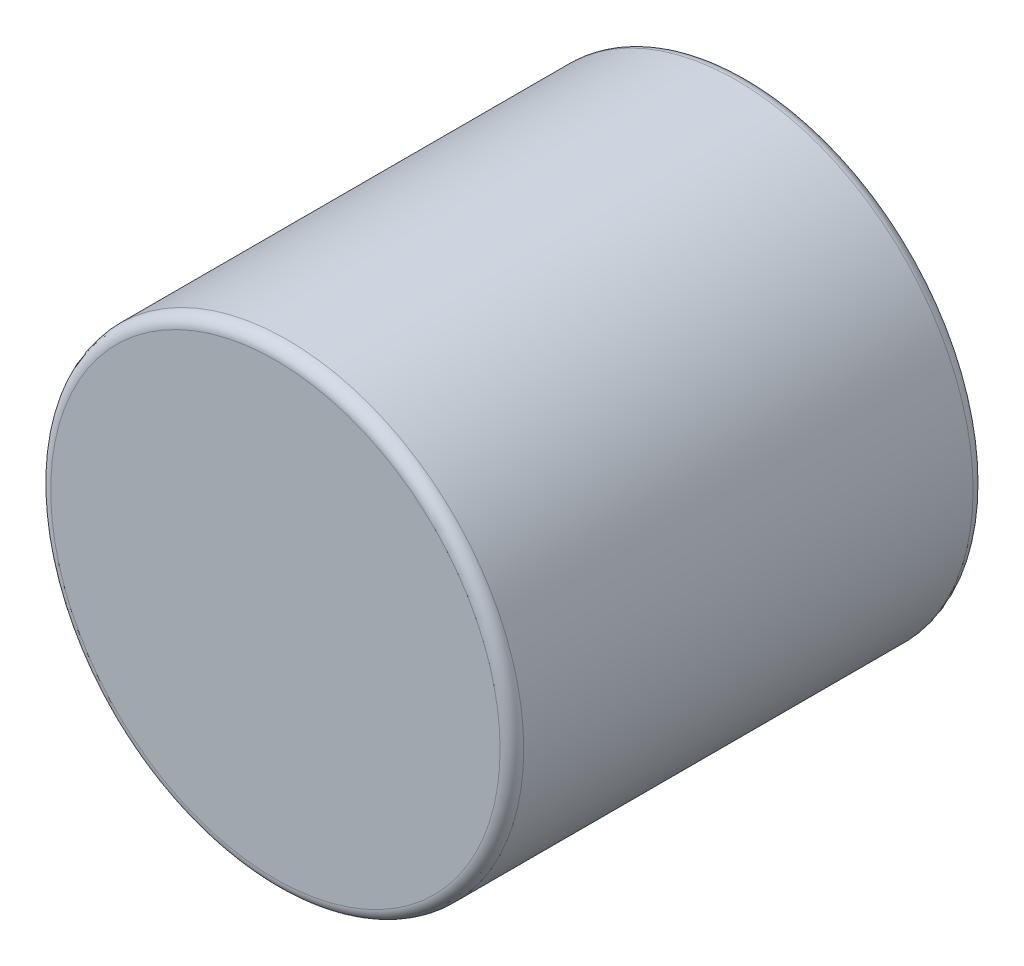
ISO-10303-21;
HEADER;
FILE_DESCRIPTION(('STEP AP214'),'2;1');
FILE_NAME('part.step','',(''),(''),'','','');
FILE_SCHEMA(('AUTOMOTIVE_DESIGN { 1 0 10303 214 1 1 1 1 }'));
ENDSEC;
DATA;
#1=APPLICATION_CONTEXT('core data for automotive mechanical design processes');
#2=APPLICATION_PROTOCOL_DEFINITION('international standard','automotive_design',2000,#1);
#3=PRODUCT_CONTEXT('',#1,'mechanical');
#4=PRODUCT('Part','Part','',(#3));
#5=PRODUCT_RELATED_PRODUCT_CATEGORY('part','',(#4));
#6=PRODUCT_DEFINITION_FORMATION('','',#4);
#7=PRODUCT_DEFINITION_CONTEXT('part definition',#1,'design');
#8=PRODUCT_DEFINITION('design','',#6,#7);
#9=PRODUCT_DEFINITION_SHAPE('','',#8);
#10=(LENGTH_UNIT() NAMED_UNIT(*) SI_UNIT(.MILLI.,.METRE.));
#11=(NAMED_UNIT(*) PLANE_ANGLE_UNIT() SI_UNIT($,.RADIAN.));
#12=(NAMED_UNIT(*) SI_UNIT($,.STERADIAN.) SOLID_ANGLE_UNIT());
#13=UNCERTAINTY_MEASURE_WITH_UNIT(LENGTH_MEASURE(1.E-05),#10,'distance_accuracy_value','');
#14=(GEOMETRIC_REPRESENTATION_CONTEXT(3) GLOBAL_UNCERTAINTY_ASSIGNED_CONTEXT((#13)) GLOBAL_UNIT_ASSIGNED_CONTEXT((#10,
#11,#12)) REPRESENTATION_CONTEXT('',''));
#15=CARTESIAN_POINT('',(0.,0.,0.));
#16=DIRECTION('',(0.,0.,1.));
#17=DIRECTION('',(1.,0.,0.));
#18=AXIS2_PLACEMENT_3D('',#15,#16,#17);
#19=CARTESIAN_POINT('',(0.,0.,0.79375));
#20=DIRECTION('',(0.,0.,-1.));
#21=DIRECTION('',(-1.,0.,0.));
#22=AXIS2_PLACEMENT_3D('',#19,#20,#21);
#23=CYLINDRICAL_SURFACE('',#22,0.79375);
#24=CARTESIAN_POINT('',(0.,0.,-0.7540625));
#25=DIRECTION('',(0.,0.,1.));
#26=DIRECTION('',(1.,0.,0.));
#27=AXIS2_PLACEMENT_3D('',#24,#25,#26);
#28=CIRCLE('',#27,0.79375);
#29=CARTESIAN_POINT('',(0.79375,0.,-0.7540625));
#30=VERTEX_POINT('',#29);
#31=EDGE_CURVE('E41',#30,#30,#28,.T.);
#32=ORIENTED_EDGE('',*,*,#31,.T.);
#33=EDGE_LOOP('',(#32));
#34=FACE_BOUND('',#33,.T.);
#35=CARTESIAN_POINT('',(0.,0.,0.7540625));
#36=DIRECTION('',(0.,0.,1.));
#37=DIRECTION('',(1.,0.,0.));
#38=AXIS2_PLACEMENT_3D('',#35,#36,#37);
#39=CIRCLE('',#38,0.79375);
#40=CARTESIAN_POINT('',(0.79375,0.,0.7540625));
#41=VERTEX_POINT('',#40);
#42=EDGE_CURVE('E45',#41,#41,#39,.F.);
#43=ORIENTED_EDGE('',*,*,#42,.T.);
#44=EDGE_LOOP('',(#43));
#45=FACE_BOUND('',#44,.T.);
#46=ADVANCED_FACE('F30',(#34,#45),#23,.T.);
#47=CARTESIAN_POINT('',(0.,0.,0.79375));
#48=DIRECTION('',(0.,0.,1.));
#49=DIRECTION('',(1.,0.,0.));
#50=AXIS2_PLACEMENT_3D('',#47,#48,#49);
#51=PLANE('',#50);
#52=CARTESIAN_POINT('',(0.,0.,0.79375));
#53=DIRECTION('',(0.,0.,1.));
#54=DIRECTION('',(1.,0.,0.));
#55=AXIS2_PLACEMENT_3D('',#52,#53,#54);
#56=CIRCLE('',#55,0.7540625);
#57=CARTESIAN_POINT('',(0.7540625,0.,0.79375));
#58=VERTEX_POINT('',#57);
#59=EDGE_CURVE('E10',#58,#58,#56,.T.);
#60=ORIENTED_EDGE('',*,*,#59,.T.);
#61=EDGE_LOOP('',(#60));
#62=FACE_BOUND('',#61,.T.);
#63=ADVANCED_FACE('F61',(#62),#51,.T.);
#64=CARTESIAN_POINT('',(0.,0.,-0.79375));
#65=DIRECTION('',(0.,0.,1.));
#66=DIRECTION('',(1.,0.,0.));
#67=AXIS2_PLACEMENT_3D('',#64,#65,#66);
#68=PLANE('',#67);
#69=CARTESIAN_POINT('',(0.,0.,-0.79375));
#70=DIRECTION('',(0.,0.,1.));
#71=DIRECTION('',(1.,0.,0.));
#72=AXIS2_PLACEMENT_3D('',#69,#70,#71);
#73=CIRCLE('',#72,0.7540625);
#74=CARTESIAN_POINT('',(0.7540625,0.,-0.79375));
#75=VERTEX_POINT('',#74);
#76=EDGE_CURVE('E37',#75,#75,#73,.F.);
#77=ORIENTED_EDGE('',*,*,#76,.T.);
#78=EDGE_LOOP('',(#77));
#79=FACE_BOUND('',#78,.T.);
#80=ADVANCED_FACE('F58',(#79),#68,.F.);
#81=CARTESIAN_POINT('',(0.,0.,-0.7540625));
#82=DIRECTION('',(0.,0.,1.));
#83=DIRECTION('',(1.,0.,0.));
#84=AXIS2_PLACEMENT_3D('',#81,#82,#83);
#85=TOROIDAL_SURFACE('',#84,0.7540625,0.0396875);
#86=ORIENTED_EDGE('',*,*,#76,.F.);
#87=EDGE_LOOP('',(#86));
#88=FACE_BOUND('',#87,.T.);
#89=ORIENTED_EDGE('',*,*,#31,.F.);
#90=EDGE_LOOP('',(#89));
#91=FACE_BOUND('',#90,.T.);
#92=ADVANCED_FACE('F54',(#88,#91),#85,.T.);
#93=CARTESIAN_POINT('',(0.,0.,0.7540625));
#94=DIRECTION('',(0.,0.,1.));
#95=DIRECTION('',(1.,0.,0.));
#96=AXIS2_PLACEMENT_3D('',#93,#94,#95);
#97=TOROIDAL_SURFACE('',#96,0.7540625,0.0396875);
#98=ORIENTED_EDGE('',*,*,#42,.F.);
#99=EDGE_LOOP('',(#98));
#100=FACE_BOUND('',#99,.T.);
#101=ORIENTED_EDGE('',*,*,#59,.F.);
#102=EDGE_LOOP('',(#101));
#103=FACE_BOUND('',#102,.T.);
#104=ADVANCED_FACE('F32',(#100,#103),#97,.T.);
#105=CLOSED_SHELL('',(#46,#63,#80,#92,#104));
#106=MANIFOLD_SOLID_BREP('B2',#105);
#107=ADVANCED_BREP_SHAPE_REPRESENTATION('',(#18,#106),#14);
#108=SHAPE_DEFINITION_REPRESENTATION(#9,#107);
ENDSEC;
END-ISO-10303-21;
